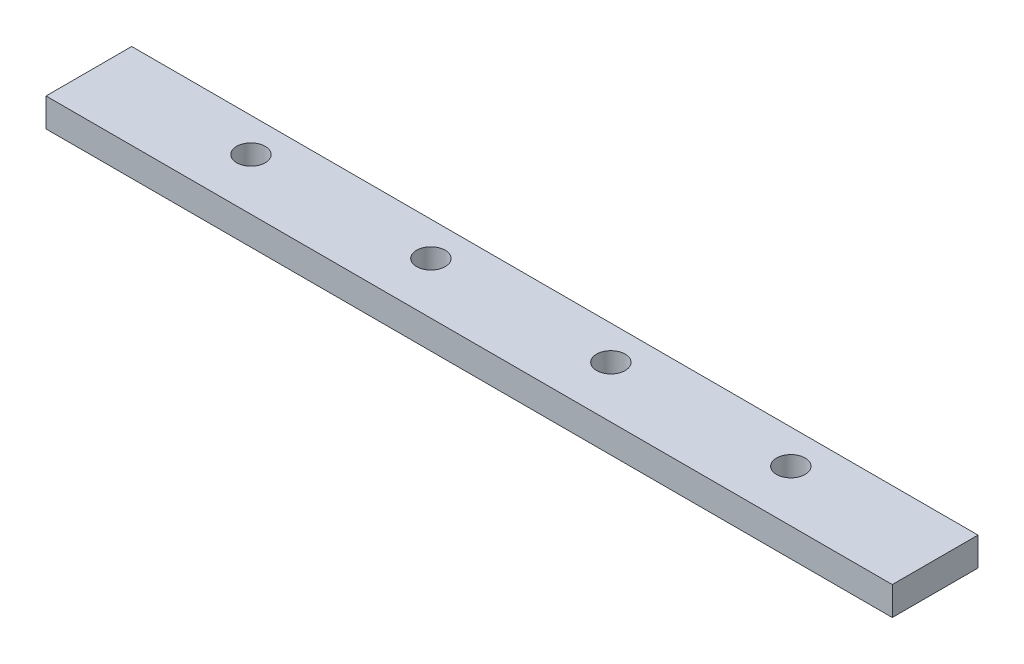
ISO-10303-21;
HEADER;
FILE_DESCRIPTION(('STEP AP214'),'2;1');
FILE_NAME('part.step','',(''),(''),'','','');
FILE_SCHEMA(('AUTOMOTIVE_DESIGN { 1 0 10303 214 1 1 1 1 }'));
ENDSEC;
DATA;
#1=APPLICATION_CONTEXT('core data for automotive mechanical design processes');
#2=APPLICATION_PROTOCOL_DEFINITION('international standard','automotive_design',2000,#1);
#3=PRODUCT_CONTEXT('',#1,'mechanical');
#4=PRODUCT('Part','Part','',(#3));
#5=PRODUCT_RELATED_PRODUCT_CATEGORY('part','',(#4));
#6=PRODUCT_DEFINITION_FORMATION('','',#4);
#7=PRODUCT_DEFINITION_CONTEXT('part definition',#1,'design');
#8=PRODUCT_DEFINITION('design','',#6,#7);
#9=PRODUCT_DEFINITION_SHAPE('','',#8);
#10=(LENGTH_UNIT() NAMED_UNIT(*) SI_UNIT(.MILLI.,.METRE.));
#11=(NAMED_UNIT(*) PLANE_ANGLE_UNIT() SI_UNIT($,.RADIAN.));
#12=(NAMED_UNIT(*) SI_UNIT($,.STERADIAN.) SOLID_ANGLE_UNIT());
#13=UNCERTAINTY_MEASURE_WITH_UNIT(LENGTH_MEASURE(1.E-05),#10,'distance_accuracy_value','');
#14=(GEOMETRIC_REPRESENTATION_CONTEXT(3) GLOBAL_UNCERTAINTY_ASSIGNED_CONTEXT((#13)) GLOBAL_UNIT_ASSIGNED_CONTEXT((#10,
#11,#12)) REPRESENTATION_CONTEXT('',''));
#15=CARTESIAN_POINT('',(0.,0.,0.));
#16=DIRECTION('',(0.,0.,1.));
#17=DIRECTION('',(1.,0.,0.));
#18=AXIS2_PLACEMENT_3D('',#15,#16,#17);
#19=CARTESIAN_POINT('',(376.2,0.,0.));
#20=DIRECTION('',(0.,0.,-1.));
#21=DIRECTION('',(-1.,0.,0.));
#22=AXIS2_PLACEMENT_3D('',#19,#20,#21);
#23=PLANE('',#22);
#24=DIRECTION('',(0.,-1.,0.));
#25=VECTOR('',#24,1.);
#26=CARTESIAN_POINT('',(0.,0.,0.));
#27=LINE('',#26,#25);
#28=CARTESIAN_POINT('',(0.,12.7,0.));
#29=VERTEX_POINT('',#28);
#30=CARTESIAN_POINT('',(0.,0.,0.));
#31=VERTEX_POINT('',#30);
#32=EDGE_CURVE('E109',#29,#31,#27,.T.);
#33=ORIENTED_EDGE('',*,*,#32,.T.);
#34=DIRECTION('',(-1.,0.,0.));
#35=VECTOR('',#34,1.);
#36=CARTESIAN_POINT('',(376.2,0.,0.));
#37=LINE('',#36,#35);
#38=CARTESIAN_POINT('',(376.2,0.,0.));
#39=VERTEX_POINT('',#38);
#40=EDGE_CURVE('E11',#39,#31,#37,.T.);
#41=ORIENTED_EDGE('',*,*,#40,.F.);
#42=DIRECTION('',(0.,-1.,0.));
#43=VECTOR('',#42,1.);
#44=CARTESIAN_POINT('',(376.2,0.,0.));
#45=LINE('',#44,#43);
#46=CARTESIAN_POINT('',(376.2,12.7,0.));
#47=VERTEX_POINT('',#46);
#48=EDGE_CURVE('E92',#47,#39,#45,.T.);
#49=ORIENTED_EDGE('',*,*,#48,.F.);
#50=DIRECTION('',(-1.,0.,0.));
#51=VECTOR('',#50,1.);
#52=CARTESIAN_POINT('',(376.2,12.7,0.));
#53=LINE('',#52,#51);
#54=EDGE_CURVE('E105',#47,#29,#53,.T.);
#55=ORIENTED_EDGE('',*,*,#54,.T.);
#56=EDGE_LOOP('',(#33,#41,#49,#55));
#57=FACE_BOUND('',#56,.T.);
#58=ADVANCED_FACE('F38',(#57),#23,.F.);
#59=CARTESIAN_POINT('',(376.2,0.,0.));
#60=DIRECTION('',(0.,1.,0.));
#61=DIRECTION('',(0.,0.,1.));
#62=AXIS2_PLACEMENT_3D('',#59,#60,#61);
#63=PLANE('',#62);
#64=CARTESIAN_POINT('',(308.1,0.,-23.));
#65=DIRECTION('',(0.,1.,0.));
#66=DIRECTION('',(0.,0.,1.));
#67=AXIS2_PLACEMENT_3D('',#64,#65,#66);
#68=CIRCLE('',#67,6.35);
#69=CARTESIAN_POINT('',(308.1,0.,-16.65));
#70=VERTEX_POINT('',#69);
#71=EDGE_CURVE('E128',#70,#70,#68,.T.);
#72=ORIENTED_EDGE('',*,*,#71,.T.);
#73=EDGE_LOOP('',(#72));
#74=FACE_BOUND('',#73,.T.);
#75=CARTESIAN_POINT('',(228.1,0.,-23.));
#76=DIRECTION('',(0.,1.,0.));
#77=DIRECTION('',(0.,0.,1.));
#78=AXIS2_PLACEMENT_3D('',#75,#76,#77);
#79=CIRCLE('',#78,6.35);
#80=CARTESIAN_POINT('',(228.1,0.,-16.65));
#81=VERTEX_POINT('',#80);
#82=EDGE_CURVE('E237',#81,#81,#79,.T.);
#83=ORIENTED_EDGE('',*,*,#82,.T.);
#84=EDGE_LOOP('',(#83));
#85=FACE_BOUND('',#84,.T.);
#86=CARTESIAN_POINT('',(148.1,0.,-23.));
#87=DIRECTION('',(0.,1.,0.));
#88=DIRECTION('',(0.,0.,1.));
#89=AXIS2_PLACEMENT_3D('',#86,#87,#88);
#90=CIRCLE('',#89,6.35);
#91=CARTESIAN_POINT('',(148.1,0.,-16.65));
#92=VERTEX_POINT('',#91);
#93=EDGE_CURVE('E229',#92,#92,#90,.T.);
#94=ORIENTED_EDGE('',*,*,#93,.T.);
#95=EDGE_LOOP('',(#94));
#96=FACE_BOUND('',#95,.T.);
#97=CARTESIAN_POINT('',(68.1,0.,-23.));
#98=DIRECTION('',(0.,1.,0.));
#99=DIRECTION('',(0.,0.,1.));
#100=AXIS2_PLACEMENT_3D('',#97,#98,#99);
#101=CIRCLE('',#100,6.35);
#102=CARTESIAN_POINT('',(68.1,0.,-16.65));
#103=VERTEX_POINT('',#102);
#104=EDGE_CURVE('E238',#103,#103,#101,.T.);
#105=ORIENTED_EDGE('',*,*,#104,.T.);
#106=EDGE_LOOP('',(#105));
#107=FACE_BOUND('',#106,.T.);
#108=DIRECTION('',(0.,0.,-1.));
#109=VECTOR('',#108,1.);
#110=CARTESIAN_POINT('',(0.,0.,0.));
#111=LINE('',#110,#109);
#112=CARTESIAN_POINT('',(0.,0.,-38.1));
#113=VERTEX_POINT('',#112);
#114=EDGE_CURVE('E97',#31,#113,#111,.T.);
#115=ORIENTED_EDGE('',*,*,#114,.T.);
#116=DIRECTION('',(-1.,0.,0.));
#117=VECTOR('',#116,1.);
#118=CARTESIAN_POINT('',(376.2,0.,-38.1));
#119=LINE('',#118,#117);
#120=CARTESIAN_POINT('',(376.2,0.,-38.1));
#121=VERTEX_POINT('',#120);
#122=EDGE_CURVE('E48',#121,#113,#119,.T.);
#123=ORIENTED_EDGE('',*,*,#122,.F.);
#124=DIRECTION('',(0.,0.,-1.));
#125=VECTOR('',#124,1.);
#126=CARTESIAN_POINT('',(376.2,0.,0.));
#127=LINE('',#126,#125);
#128=EDGE_CURVE('E87',#39,#121,#127,.T.);
#129=ORIENTED_EDGE('',*,*,#128,.F.);
#130=ORIENTED_EDGE('',*,*,#40,.T.);
#131=EDGE_LOOP('',(#115,#123,#129,#130));
#132=FACE_BOUND('',#131,.T.);
#133=ADVANCED_FACE('F96',(#74,#85,#96,#107,#132),#63,.F.);
#134=CARTESIAN_POINT('',(376.2,0.,-38.1));
#135=DIRECTION('',(0.,0.,1.));
#136=DIRECTION('',(0.,-1.,0.));
#137=AXIS2_PLACEMENT_3D('',#134,#135,#136);
#138=PLANE('',#137);
#139=DIRECTION('',(0.,1.,0.));
#140=VECTOR('',#139,1.);
#141=CARTESIAN_POINT('',(0.,0.,-38.1));
#142=LINE('',#141,#140);
#143=CARTESIAN_POINT('',(0.,12.7,-38.1));
#144=VERTEX_POINT('',#143);
#145=EDGE_CURVE('E74',#113,#144,#142,.T.);
#146=ORIENTED_EDGE('',*,*,#145,.T.);
#147=DIRECTION('',(-1.,0.,0.));
#148=VECTOR('',#147,1.);
#149=CARTESIAN_POINT('',(376.2,12.7,-38.1));
#150=LINE('',#149,#148);
#151=CARTESIAN_POINT('',(376.2,12.7,-38.1));
#152=VERTEX_POINT('',#151);
#153=EDGE_CURVE('E99',#152,#144,#150,.T.);
#154=ORIENTED_EDGE('',*,*,#153,.F.);
#155=DIRECTION('',(0.,1.,0.));
#156=VECTOR('',#155,1.);
#157=CARTESIAN_POINT('',(376.2,0.,-38.1));
#158=LINE('',#157,#156);
#159=EDGE_CURVE('E90',#121,#152,#158,.T.);
#160=ORIENTED_EDGE('',*,*,#159,.F.);
#161=ORIENTED_EDGE('',*,*,#122,.T.);
#162=EDGE_LOOP('',(#146,#154,#160,#161));
#163=FACE_BOUND('',#162,.T.);
#164=ADVANCED_FACE('F101',(#163),#138,.F.);
#165=CARTESIAN_POINT('',(376.2,12.7,0.));
#166=DIRECTION('',(0.,-1.,0.));
#167=DIRECTION('',(0.,0.,-1.));
#168=AXIS2_PLACEMENT_3D('',#165,#166,#167);
#169=PLANE('',#168);
#170=CARTESIAN_POINT('',(308.1,12.7,-23.));
#171=DIRECTION('',(0.,-1.,0.));
#172=DIRECTION('',(0.,0.,-1.));
#173=AXIS2_PLACEMENT_3D('',#170,#171,#172);
#174=CIRCLE('',#173,6.35);
#175=CARTESIAN_POINT('',(308.1,12.7,-29.35));
#176=VERTEX_POINT('',#175);
#177=EDGE_CURVE('E41',#176,#176,#174,.T.);
#178=ORIENTED_EDGE('',*,*,#177,.T.);
#179=EDGE_LOOP('',(#178));
#180=FACE_BOUND('',#179,.T.);
#181=CARTESIAN_POINT('',(228.1,12.7,-23.));
#182=DIRECTION('',(0.,-1.,0.));
#183=DIRECTION('',(0.,0.,-1.));
#184=AXIS2_PLACEMENT_3D('',#181,#182,#183);
#185=CIRCLE('',#184,6.35);
#186=CARTESIAN_POINT('',(228.1,12.7,-29.35));
#187=VERTEX_POINT('',#186);
#188=EDGE_CURVE('E131',#187,#187,#185,.T.);
#189=ORIENTED_EDGE('',*,*,#188,.T.);
#190=EDGE_LOOP('',(#189));
#191=FACE_BOUND('',#190,.T.);
#192=CARTESIAN_POINT('',(148.1,12.7,-23.));
#193=DIRECTION('',(0.,-1.,0.));
#194=DIRECTION('',(0.,0.,-1.));
#195=AXIS2_PLACEMENT_3D('',#192,#193,#194);
#196=CIRCLE('',#195,6.35);
#197=CARTESIAN_POINT('',(148.1,12.7,-29.35));
#198=VERTEX_POINT('',#197);
#199=EDGE_CURVE('E127',#198,#198,#196,.T.);
#200=ORIENTED_EDGE('',*,*,#199,.T.);
#201=EDGE_LOOP('',(#200));
#202=FACE_BOUND('',#201,.T.);
#203=CARTESIAN_POINT('',(68.1,12.7,-23.));
#204=DIRECTION('',(0.,-1.,0.));
#205=DIRECTION('',(0.,0.,-1.));
#206=AXIS2_PLACEMENT_3D('',#203,#204,#205);
#207=CIRCLE('',#206,6.35);
#208=CARTESIAN_POINT('',(68.1,12.7,-29.35));
#209=VERTEX_POINT('',#208);
#210=EDGE_CURVE('E123',#209,#209,#207,.T.);
#211=ORIENTED_EDGE('',*,*,#210,.T.);
#212=EDGE_LOOP('',(#211));
#213=FACE_BOUND('',#212,.T.);
#214=DIRECTION('',(0.,0.,1.));
#215=VECTOR('',#214,1.);
#216=CARTESIAN_POINT('',(0.,12.7,0.));
#217=LINE('',#216,#215);
#218=EDGE_CURVE('E80',#144,#29,#217,.T.);
#219=ORIENTED_EDGE('',*,*,#218,.T.);
#220=ORIENTED_EDGE('',*,*,#54,.F.);
#221=DIRECTION('',(0.,0.,1.));
#222=VECTOR('',#221,1.);
#223=CARTESIAN_POINT('',(376.2,12.7,0.));
#224=LINE('',#223,#222);
#225=EDGE_CURVE('E57',#152,#47,#224,.T.);
#226=ORIENTED_EDGE('',*,*,#225,.F.);
#227=ORIENTED_EDGE('',*,*,#153,.T.);
#228=EDGE_LOOP('',(#219,#220,#226,#227));
#229=FACE_BOUND('',#228,.T.);
#230=ADVANCED_FACE('F140',(#180,#191,#202,#213,#229),#169,.F.);
#231=CARTESIAN_POINT('',(376.2,0.,0.));
#232=DIRECTION('',(-1.,0.,0.));
#233=DIRECTION('',(0.,0.,1.));
#234=AXIS2_PLACEMENT_3D('',#231,#232,#233);
#235=PLANE('',#234);
#236=ORIENTED_EDGE('',*,*,#48,.T.);
#237=ORIENTED_EDGE('',*,*,#128,.T.);
#238=ORIENTED_EDGE('',*,*,#159,.T.);
#239=ORIENTED_EDGE('',*,*,#225,.T.);
#240=EDGE_LOOP('',(#236,#237,#238,#239));
#241=FACE_BOUND('',#240,.T.);
#242=ADVANCED_FACE('F88',(#241),#235,.F.);
#243=CARTESIAN_POINT('',(0.,0.,0.));
#244=DIRECTION('',(-1.,0.,0.));
#245=DIRECTION('',(0.,0.,1.));
#246=AXIS2_PLACEMENT_3D('',#243,#244,#245);
#247=PLANE('',#246);
#248=ORIENTED_EDGE('',*,*,#32,.F.);
#249=ORIENTED_EDGE('',*,*,#218,.F.);
#250=ORIENTED_EDGE('',*,*,#145,.F.);
#251=ORIENTED_EDGE('',*,*,#114,.F.);
#252=EDGE_LOOP('',(#248,#249,#250,#251));
#253=FACE_BOUND('',#252,.T.);
#254=ADVANCED_FACE('F163',(#253),#247,.T.);
#255=CARTESIAN_POINT('',(68.1,0.,-23.));
#256=DIRECTION('',(0.,1.,0.));
#257=DIRECTION('',(0.,0.,1.));
#258=AXIS2_PLACEMENT_3D('',#255,#256,#257);
#259=CYLINDRICAL_SURFACE('',#258,6.35);
#260=ORIENTED_EDGE('',*,*,#104,.F.);
#261=EDGE_LOOP('',(#260));
#262=FACE_BOUND('',#261,.T.);
#263=ORIENTED_EDGE('',*,*,#210,.F.);
#264=EDGE_LOOP('',(#263));
#265=FACE_BOUND('',#264,.T.);
#266=ADVANCED_FACE('F165',(#262,#265),#259,.F.);
#267=CARTESIAN_POINT('',(148.1,0.,-23.));
#268=DIRECTION('',(0.,1.,0.));
#269=DIRECTION('',(0.,0.,1.));
#270=AXIS2_PLACEMENT_3D('',#267,#268,#269);
#271=CYLINDRICAL_SURFACE('',#270,6.35);
#272=ORIENTED_EDGE('',*,*,#93,.F.);
#273=EDGE_LOOP('',(#272));
#274=FACE_BOUND('',#273,.T.);
#275=ORIENTED_EDGE('',*,*,#199,.F.);
#276=EDGE_LOOP('',(#275));
#277=FACE_BOUND('',#276,.T.);
#278=ADVANCED_FACE('F150',(#274,#277),#271,.F.);
#279=CARTESIAN_POINT('',(228.1,0.,-23.));
#280=DIRECTION('',(0.,1.,0.));
#281=DIRECTION('',(0.,0.,1.));
#282=AXIS2_PLACEMENT_3D('',#279,#280,#281);
#283=CYLINDRICAL_SURFACE('',#282,6.35);
#284=ORIENTED_EDGE('',*,*,#82,.F.);
#285=EDGE_LOOP('',(#284));
#286=FACE_BOUND('',#285,.T.);
#287=ORIENTED_EDGE('',*,*,#188,.F.);
#288=EDGE_LOOP('',(#287));
#289=FACE_BOUND('',#288,.T.);
#290=ADVANCED_FACE('F144',(#286,#289),#283,.F.);
#291=CARTESIAN_POINT('',(308.1,0.,-23.));
#292=DIRECTION('',(0.,1.,0.));
#293=DIRECTION('',(0.,0.,1.));
#294=AXIS2_PLACEMENT_3D('',#291,#292,#293);
#295=CYLINDRICAL_SURFACE('',#294,6.35);
#296=ORIENTED_EDGE('',*,*,#71,.F.);
#297=EDGE_LOOP('',(#296));
#298=FACE_BOUND('',#297,.T.);
#299=ORIENTED_EDGE('',*,*,#177,.F.);
#300=EDGE_LOOP('',(#299));
#301=FACE_BOUND('',#300,.T.);
#302=ADVANCED_FACE('F142',(#298,#301),#295,.F.);
#303=CLOSED_SHELL('',(#58,#133,#164,#230,#242,#254,#266,#278,#290,#302));
#304=MANIFOLD_SOLID_BREP('B2',#303);
#305=ADVANCED_BREP_SHAPE_REPRESENTATION('',(#18,#304),#14);
#306=SHAPE_DEFINITION_REPRESENTATION(#9,#305);
ENDSEC;
END-ISO-10303-21;
